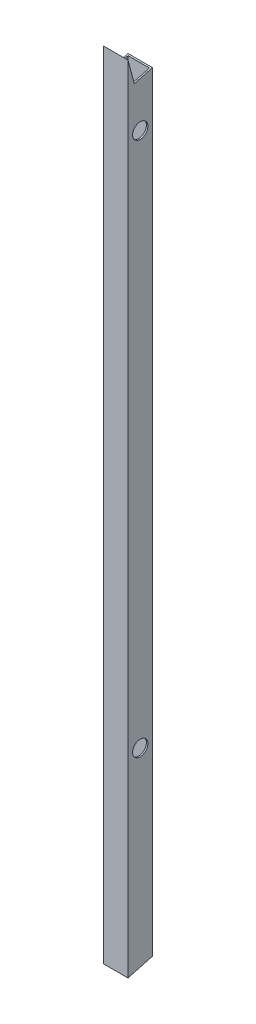
ISO-10303-21;
HEADER;
FILE_DESCRIPTION(('STEP AP214'),'2;1');
FILE_NAME('part.step','',(''),(''),'','','');
FILE_SCHEMA(('AUTOMOTIVE_DESIGN { 1 0 10303 214 1 1 1 1 }'));
ENDSEC;
DATA;
#1=APPLICATION_CONTEXT('core data for automotive mechanical design processes');
#2=APPLICATION_PROTOCOL_DEFINITION('international standard','automotive_design',2000,#1);
#3=PRODUCT_CONTEXT('',#1,'mechanical');
#4=PRODUCT('Part','Part','',(#3));
#5=PRODUCT_RELATED_PRODUCT_CATEGORY('part','',(#4));
#6=PRODUCT_DEFINITION_FORMATION('','',#4);
#7=PRODUCT_DEFINITION_CONTEXT('part definition',#1,'design');
#8=PRODUCT_DEFINITION('design','',#6,#7);
#9=PRODUCT_DEFINITION_SHAPE('','',#8);
#10=(LENGTH_UNIT() NAMED_UNIT(*) SI_UNIT(.MILLI.,.METRE.));
#11=(NAMED_UNIT(*) PLANE_ANGLE_UNIT() SI_UNIT($,.RADIAN.));
#12=(NAMED_UNIT(*) SI_UNIT($,.STERADIAN.) SOLID_ANGLE_UNIT());
#13=UNCERTAINTY_MEASURE_WITH_UNIT(LENGTH_MEASURE(1.E-05),#10,'distance_accuracy_value','');
#14=(GEOMETRIC_REPRESENTATION_CONTEXT(3) GLOBAL_UNCERTAINTY_ASSIGNED_CONTEXT((#13)) GLOBAL_UNIT_ASSIGNED_CONTEXT((#10,
#11,#12)) REPRESENTATION_CONTEXT('',''));
#15=CARTESIAN_POINT('',(0.,0.,0.));
#16=DIRECTION('',(0.,0.,1.));
#17=DIRECTION('',(1.,0.,0.));
#18=AXIS2_PLACEMENT_3D('',#15,#16,#17);
#19=CARTESIAN_POINT('',(-59.3551112863002,883.666,-50.376591230911));
#20=DIRECTION('',(1.,0.,0.));
#21=DIRECTION('',(0.,0.,-1.));
#22=AXIS2_PLACEMENT_3D('',#19,#20,#21);
#23=PLANE('',#22);
#24=CARTESIAN_POINT('',(-59.3551112863002,813.943,-37.676591230911));
#25=DIRECTION('',(1.,0.,0.));
#26=DIRECTION('',(0.,0.,-1.));
#27=AXIS2_PLACEMENT_3D('',#24,#25,#26);
#28=CIRCLE('',#27,7.93750000000006);
#29=CARTESIAN_POINT('',(-59.3551112863002,813.943,-45.6140912309111));
#30=VERTEX_POINT('',#29);
#31=EDGE_CURVE('E148',#30,#30,#28,.T.);
#32=ORIENTED_EDGE('',*,*,#31,.T.);
#33=EDGE_LOOP('',(#32));
#34=FACE_BOUND('',#33,.T.);
#35=CARTESIAN_POINT('',(-59.3551112863002,258.318,-37.676591230911));
#36=DIRECTION('',(1.,0.,0.));
#37=DIRECTION('',(0.,0.,-1.));
#38=AXIS2_PLACEMENT_3D('',#35,#36,#37);
#39=CIRCLE('',#38,7.93750000000003);
#40=CARTESIAN_POINT('',(-59.3551112863002,258.318,-45.6140912309111));
#41=VERTEX_POINT('',#40);
#42=EDGE_CURVE('E144',#41,#41,#39,.T.);
#43=ORIENTED_EDGE('',*,*,#42,.T.);
#44=EDGE_LOOP('',(#43));
#45=FACE_BOUND('',#44,.T.);
#46=DIRECTION('',(0.,-1.,0.));
#47=VECTOR('',#46,1.);
#48=CARTESIAN_POINT('',(-59.3551112863002,883.666,-50.376591230911));
#49=LINE('',#48,#47);
#50=CARTESIAN_POINT('',(-59.3551112863002,864.264645772529,-50.376591230911));
#51=VERTEX_POINT('',#50);
#52=CARTESIAN_POINT('',(-59.3551112863002,64.516,-50.376591230911));
#53=VERTEX_POINT('',#52);
#54=EDGE_CURVE('E127',#51,#53,#49,.T.);
#55=ORIENTED_EDGE('',*,*,#54,.T.);
#56=DIRECTION('',(0.,-0.260665852290765,0.965429082558387));
#57=VECTOR('',#56,1.);
#58=CARTESIAN_POINT('',(-59.3551112863002,57.658,-24.976591230911));
#59=LINE('',#58,#57);
#60=CARTESIAN_POINT('',(-59.3551112863002,57.658,-24.976591230911));
#61=VERTEX_POINT('',#60);
#62=EDGE_CURVE('E51',#53,#61,#59,.T.);
#63=ORIENTED_EDGE('',*,*,#62,.T.);
#64=DIRECTION('',(0.,-1.,0.));
#65=VECTOR('',#64,1.);
#66=CARTESIAN_POINT('',(-59.3551112863002,883.666,-24.976591230911));
#67=LINE('',#66,#65);
#68=CARTESIAN_POINT('',(-59.3551112863002,883.666,-24.976591230911));
#69=VERTEX_POINT('',#68);
#70=EDGE_CURVE('E124',#69,#61,#67,.T.);
#71=ORIENTED_EDGE('',*,*,#70,.F.);
#72=DIRECTION('',(0.,-0.965925826289067,-0.258819045102525));
#73=VECTOR('',#72,1.);
#74=CARTESIAN_POINT('',(-59.3551112863002,883.666,-24.976591230911));
#75=LINE('',#74,#73);
#76=CARTESIAN_POINT('',(-59.3551112863002,859.214290071859,-31.5284071597166));
#77=VERTEX_POINT('',#76);
#78=EDGE_CURVE('E193',#69,#77,#75,.T.);
#79=ORIENTED_EDGE('',*,*,#78,.T.);
#80=DIRECTION('',(0.,0.258819045102531,-0.965925826289066));
#81=VECTOR('',#80,1.);
#82=CARTESIAN_POINT('',(-59.3551112863002,859.214290071859,-31.5284071597166));
#83=LINE('',#82,#81);
#84=EDGE_CURVE('E196',#77,#51,#83,.T.);
#85=ORIENTED_EDGE('',*,*,#84,.T.);
#86=EDGE_LOOP('',(#55,#63,#71,#79,#85));
#87=FACE_BOUND('',#86,.T.);
#88=ADVANCED_FACE('F37',(#34,#45,#87),#23,.F.);
#89=CARTESIAN_POINT('',(-59.3551112863002,883.666,-24.976591230911));
#90=DIRECTION('',(0.,0.,-1.));
#91=DIRECTION('',(-1.,0.,0.));
#92=AXIS2_PLACEMENT_3D('',#89,#90,#91);
#93=PLANE('',#92);
#94=ORIENTED_EDGE('',*,*,#70,.T.);
#95=DIRECTION('',(1.,0.,0.));
#96=VECTOR('',#95,1.);
#97=CARTESIAN_POINT('',(-59.3551112863002,57.658,-24.976591230911));
#98=LINE('',#97,#96);
#99=CARTESIAN_POINT('',(-33.9551112863002,57.658,-24.976591230911));
#100=VERTEX_POINT('',#99);
#101=EDGE_CURVE('E110',#61,#100,#98,.T.);
#102=ORIENTED_EDGE('',*,*,#101,.T.);
#103=DIRECTION('',(0.,-1.,0.));
#104=VECTOR('',#103,1.);
#105=CARTESIAN_POINT('',(-33.9551112863002,883.666,-24.976591230911));
#106=LINE('',#105,#104);
#107=CARTESIAN_POINT('',(-33.9551112863002,883.666,-24.976591230911));
#108=VERTEX_POINT('',#107);
#109=EDGE_CURVE('E133',#108,#100,#106,.T.);
#110=ORIENTED_EDGE('',*,*,#109,.F.);
#111=DIRECTION('',(1.,0.,0.));
#112=VECTOR('',#111,1.);
#113=CARTESIAN_POINT('',(-59.3551112863002,883.666,-24.976591230911));
#114=LINE('',#113,#112);
#115=EDGE_CURVE('E131',#69,#108,#114,.T.);
#116=ORIENTED_EDGE('',*,*,#115,.F.);
#117=EDGE_LOOP('',(#94,#102,#110,#116));
#118=FACE_BOUND('',#117,.T.);
#119=ADVANCED_FACE('F130',(#118),#93,.F.);
#120=CARTESIAN_POINT('',(-33.9551112863002,883.666,-50.376591230911));
#121=DIRECTION('',(-1.,0.,0.));
#122=DIRECTION('',(0.,0.,1.));
#123=AXIS2_PLACEMENT_3D('',#120,#121,#122);
#124=PLANE('',#123);
#125=CARTESIAN_POINT('',(-33.9551112863002,813.943,-37.676591230911));
#126=DIRECTION('',(-1.,0.,0.));
#127=DIRECTION('',(0.,0.,1.));
#128=AXIS2_PLACEMENT_3D('',#125,#126,#127);
#129=CIRCLE('',#128,7.93750000000006);
#130=CARTESIAN_POINT('',(-33.9551112863002,813.943,-29.739091230911));
#131=VERTEX_POINT('',#130);
#132=EDGE_CURVE('E219',#131,#131,#129,.T.);
#133=ORIENTED_EDGE('',*,*,#132,.T.);
#134=EDGE_LOOP('',(#133));
#135=FACE_BOUND('',#134,.T.);
#136=CARTESIAN_POINT('',(-33.9551112863002,258.318,-37.676591230911));
#137=DIRECTION('',(-1.,0.,0.));
#138=DIRECTION('',(0.,0.,1.));
#139=AXIS2_PLACEMENT_3D('',#136,#137,#138);
#140=CIRCLE('',#139,7.93750000000003);
#141=CARTESIAN_POINT('',(-33.9551112863002,258.318,-29.739091230911));
#142=VERTEX_POINT('',#141);
#143=EDGE_CURVE('E226',#142,#142,#140,.T.);
#144=ORIENTED_EDGE('',*,*,#143,.T.);
#145=EDGE_LOOP('',(#144));
#146=FACE_BOUND('',#145,.T.);
#147=ORIENTED_EDGE('',*,*,#109,.T.);
#148=DIRECTION('',(0.,0.260665852290765,-0.965429082558387));
#149=VECTOR('',#148,1.);
#150=CARTESIAN_POINT('',(-33.9551112863002,120.174528287818,-256.519288593201));
#151=LINE('',#150,#149);
#152=CARTESIAN_POINT('',(-33.9551112863002,64.516,-50.376591230911));
#153=VERTEX_POINT('',#152);
#154=EDGE_CURVE('E113',#100,#153,#151,.T.);
#155=ORIENTED_EDGE('',*,*,#154,.T.);
#156=DIRECTION('',(0.,-1.,0.));
#157=VECTOR('',#156,1.);
#158=CARTESIAN_POINT('',(-33.9551112863002,883.666,-50.376591230911));
#159=LINE('',#158,#157);
#160=CARTESIAN_POINT('',(-33.9551112863002,864.264645772529,-50.376591230911));
#161=VERTEX_POINT('',#160);
#162=EDGE_CURVE('E136',#161,#153,#159,.T.);
#163=ORIENTED_EDGE('',*,*,#162,.F.);
#164=DIRECTION('',(0.,-0.258819045102531,0.965925826289066));
#165=VECTOR('',#164,1.);
#166=CARTESIAN_POINT('',(-33.9551112863002,865.564290071859,-55.226929787779));
#167=LINE('',#166,#165);
#168=CARTESIAN_POINT('',(-33.9551112863002,859.214290071859,-31.5284071597166));
#169=VERTEX_POINT('',#168);
#170=EDGE_CURVE('E170',#161,#169,#167,.T.);
#171=ORIENTED_EDGE('',*,*,#170,.T.);
#172=DIRECTION('',(0.,0.965925826289067,0.258819045102525));
#173=VECTOR('',#172,1.);
#174=CARTESIAN_POINT('',(-33.9551112863002,877.316,-26.6780686028487));
#175=LINE('',#174,#173);
#176=EDGE_CURVE('E213',#169,#108,#175,.T.);
#177=ORIENTED_EDGE('',*,*,#176,.T.);
#178=EDGE_LOOP('',(#147,#155,#163,#171,#177));
#179=FACE_BOUND('',#178,.T.);
#180=ADVANCED_FACE('F191',(#135,#146,#179),#124,.F.);
#181=CARTESIAN_POINT('',(-59.3551112863002,883.666,-50.376591230911));
#182=DIRECTION('',(0.,0.,1.));
#183=DIRECTION('',(1.,0.,0.));
#184=AXIS2_PLACEMENT_3D('',#181,#182,#183);
#185=PLANE('',#184);
#186=ORIENTED_EDGE('',*,*,#162,.T.);
#187=DIRECTION('',(1.,0.,0.));
#188=VECTOR('',#187,1.);
#189=CARTESIAN_POINT('',(-59.3551112863002,64.516,-50.376591230911));
#190=LINE('',#189,#188);
#191=EDGE_CURVE('E118',#53,#153,#190,.T.);
#192=ORIENTED_EDGE('',*,*,#191,.F.);
#193=ORIENTED_EDGE('',*,*,#54,.F.);
#194=DIRECTION('',(1.,0.,0.));
#195=VECTOR('',#194,1.);
#196=CARTESIAN_POINT('',(-59.3551112863002,864.264645772529,-50.376591230911));
#197=LINE('',#196,#195);
#198=EDGE_CURVE('E188',#51,#161,#197,.T.);
#199=ORIENTED_EDGE('',*,*,#198,.T.);
#200=EDGE_LOOP('',(#186,#192,#193,#199));
#201=FACE_BOUND('',#200,.T.);
#202=ADVANCED_FACE('F187',(#201),#185,.F.);
#203=CARTESIAN_POINT('',(-57.8311112863002,883.666,-48.852591230911));
#204=DIRECTION('',(1.,0.,0.));
#205=DIRECTION('',(0.,0.,-1.));
#206=AXIS2_PLACEMENT_3D('',#203,#204,#205);
#207=PLANE('',#206);
#208=DIRECTION('',(0.,-0.260665852290765,0.965429082558387));
#209=VECTOR('',#208,1.);
#210=CARTESIAN_POINT('',(-57.8311112863002,119.7910069904,-255.098839343504));
#211=LINE('',#210,#209);
#212=CARTESIAN_POINT('',(-57.8311112863002,64.1045200000001,-48.852591230911));
#213=VERTEX_POINT('',#212);
#214=CARTESIAN_POINT('',(-57.8311112863002,58.06948,-26.500591230911));
#215=VERTEX_POINT('',#214);
#216=EDGE_CURVE('E194',#213,#215,#211,.T.);
#217=ORIENTED_EDGE('',*,*,#216,.F.);
#218=DIRECTION('',(0.,-1.,0.));
#219=VECTOR('',#218,1.);
#220=CARTESIAN_POINT('',(-57.8311112863002,883.666,-48.852591230911));
#221=LINE('',#220,#219);
#222=CARTESIAN_POINT('',(-57.8311112863002,863.856291203264,-48.852591230911));
#223=VERTEX_POINT('',#222);
#224=EDGE_CURVE('E178',#223,#213,#221,.T.);
#225=ORIENTED_EDGE('',*,*,#224,.F.);
#226=DIRECTION('',(0.,0.258819045102531,-0.965925826289066));
#227=VECTOR('',#226,1.);
#228=CARTESIAN_POINT('',(-57.8311112863002,865.183290071859,-53.8050184300952));
#229=LINE('',#228,#227);
#230=CARTESIAN_POINT('',(-57.8311112863002,859.214290071859,-31.5284071597166));
#231=VERTEX_POINT('',#230);
#232=EDGE_CURVE('E209',#231,#223,#229,.T.);
#233=ORIENTED_EDGE('',*,*,#232,.F.);
#234=DIRECTION('',(0.,-0.965925826289067,-0.258819045102525));
#235=VECTOR('',#234,1.);
#236=CARTESIAN_POINT('',(-57.8311112863002,877.697,-26.5759799605325));
#237=LINE('',#236,#235);
#238=CARTESIAN_POINT('',(-57.8311112863002,877.978354569265,-26.500591230911));
#239=VERTEX_POINT('',#238);
#240=EDGE_CURVE('E169',#239,#231,#237,.T.);
#241=ORIENTED_EDGE('',*,*,#240,.F.);
#242=DIRECTION('',(0.,-1.,0.));
#243=VECTOR('',#242,1.);
#244=CARTESIAN_POINT('',(-57.8311112863002,883.666,-26.500591230911));
#245=LINE('',#244,#243);
#246=EDGE_CURVE('E168',#239,#215,#245,.T.);
#247=ORIENTED_EDGE('',*,*,#246,.T.);
#248=EDGE_LOOP('',(#217,#225,#233,#241,#247));
#249=FACE_BOUND('',#248,.T.);
#250=CARTESIAN_POINT('',(-57.8311112863002,813.943,-37.676591230911));
#251=DIRECTION('',(1.,0.,0.));
#252=DIRECTION('',(0.,0.,-1.));
#253=AXIS2_PLACEMENT_3D('',#250,#251,#252);
#254=CIRCLE('',#253,7.93750000000006);
#255=CARTESIAN_POINT('',(-57.8311112863002,813.943,-45.6140912309111));
#256=VERTEX_POINT('',#255);
#257=EDGE_CURVE('E147',#256,#256,#254,.T.);
#258=ORIENTED_EDGE('',*,*,#257,.F.);
#259=EDGE_LOOP('',(#258));
#260=FACE_BOUND('',#259,.T.);
#261=CARTESIAN_POINT('',(-57.8311112863002,258.318,-37.676591230911));
#262=DIRECTION('',(1.,0.,0.));
#263=DIRECTION('',(0.,0.,-1.));
#264=AXIS2_PLACEMENT_3D('',#261,#262,#263);
#265=CIRCLE('',#264,7.93750000000003);
#266=CARTESIAN_POINT('',(-57.8311112863002,258.318,-45.6140912309111));
#267=VERTEX_POINT('',#266);
#268=EDGE_CURVE('E143',#267,#267,#265,.T.);
#269=ORIENTED_EDGE('',*,*,#268,.F.);
#270=EDGE_LOOP('',(#269));
#271=FACE_BOUND('',#270,.T.);
#272=ADVANCED_FACE('F237',(#249,#260,#271),#207,.T.);
#273=CARTESIAN_POINT('',(-57.8311112863002,883.666,-26.500591230911));
#274=DIRECTION('',(0.,0.,-1.));
#275=DIRECTION('',(-1.,0.,0.));
#276=AXIS2_PLACEMENT_3D('',#273,#274,#275);
#277=PLANE('',#276);
#278=DIRECTION('',(1.,0.,0.));
#279=VECTOR('',#278,1.);
#280=CARTESIAN_POINT('',(-57.8311112863002,58.06948,-26.500591230911));
#281=LINE('',#280,#279);
#282=CARTESIAN_POINT('',(-35.4791112863002,58.06948,-26.500591230911));
#283=VERTEX_POINT('',#282);
#284=EDGE_CURVE('E198',#215,#283,#281,.T.);
#285=ORIENTED_EDGE('',*,*,#284,.F.);
#286=ORIENTED_EDGE('',*,*,#246,.F.);
#287=DIRECTION('',(-1.,0.,0.));
#288=VECTOR('',#287,1.);
#289=CARTESIAN_POINT('',(-57.8311112863002,877.978354569265,-26.500591230911));
#290=LINE('',#289,#288);
#291=CARTESIAN_POINT('',(-35.4791112863002,877.978354569265,-26.500591230911));
#292=VERTEX_POINT('',#291);
#293=EDGE_CURVE('E154',#292,#239,#290,.T.);
#294=ORIENTED_EDGE('',*,*,#293,.F.);
#295=DIRECTION('',(0.,-1.,0.));
#296=VECTOR('',#295,1.);
#297=CARTESIAN_POINT('',(-35.4791112863002,883.666,-26.500591230911));
#298=LINE('',#297,#296);
#299=EDGE_CURVE('E166',#292,#283,#298,.T.);
#300=ORIENTED_EDGE('',*,*,#299,.T.);
#301=EDGE_LOOP('',(#285,#286,#294,#300));
#302=FACE_BOUND('',#301,.T.);
#303=ADVANCED_FACE('F165',(#302),#277,.T.);
#304=CARTESIAN_POINT('',(-35.4791112863002,883.666,-48.852591230911));
#305=DIRECTION('',(-1.,0.,0.));
#306=DIRECTION('',(0.,0.,1.));
#307=AXIS2_PLACEMENT_3D('',#304,#305,#306);
#308=PLANE('',#307);
#309=DIRECTION('',(0.,0.260665852290765,-0.965429082558387));
#310=VECTOR('',#309,1.);
#311=CARTESIAN_POINT('',(-35.4791112863002,119.7910069904,-255.098839343504));
#312=LINE('',#311,#310);
#313=CARTESIAN_POINT('',(-35.4791112863002,64.1045200000001,-48.852591230911));
#314=VERTEX_POINT('',#313);
#315=EDGE_CURVE('E58',#283,#314,#312,.T.);
#316=ORIENTED_EDGE('',*,*,#315,.F.);
#317=ORIENTED_EDGE('',*,*,#299,.F.);
#318=DIRECTION('',(0.,0.965925826289067,0.258819045102525));
#319=VECTOR('',#318,1.);
#320=CARTESIAN_POINT('',(-35.4791112863002,877.697,-26.5759799605325));
#321=LINE('',#320,#319);
#322=CARTESIAN_POINT('',(-35.4791112863002,859.214290071859,-31.5284071597166));
#323=VERTEX_POINT('',#322);
#324=EDGE_CURVE('E44',#323,#292,#321,.T.);
#325=ORIENTED_EDGE('',*,*,#324,.F.);
#326=DIRECTION('',(0.,-0.258819045102531,0.965925826289066));
#327=VECTOR('',#326,1.);
#328=CARTESIAN_POINT('',(-35.4791112863002,865.183290071859,-53.8050184300952));
#329=LINE('',#328,#327);
#330=CARTESIAN_POINT('',(-35.4791112863002,863.856291203264,-48.852591230911));
#331=VERTEX_POINT('',#330);
#332=EDGE_CURVE('E204',#331,#323,#329,.T.);
#333=ORIENTED_EDGE('',*,*,#332,.F.);
#334=DIRECTION('',(0.,-1.,0.));
#335=VECTOR('',#334,1.);
#336=CARTESIAN_POINT('',(-35.4791112863002,883.666,-48.852591230911));
#337=LINE('',#336,#335);
#338=EDGE_CURVE('E175',#331,#314,#337,.T.);
#339=ORIENTED_EDGE('',*,*,#338,.T.);
#340=EDGE_LOOP('',(#316,#317,#325,#333,#339));
#341=FACE_BOUND('',#340,.T.);
#342=CARTESIAN_POINT('',(-35.4791112863002,813.943,-37.676591230911));
#343=DIRECTION('',(-1.,0.,0.));
#344=DIRECTION('',(0.,0.,1.));
#345=AXIS2_PLACEMENT_3D('',#342,#343,#344);
#346=CIRCLE('',#345,7.93750000000006);
#347=CARTESIAN_POINT('',(-35.4791112863002,813.943,-29.739091230911));
#348=VERTEX_POINT('',#347);
#349=EDGE_CURVE('E145',#348,#348,#346,.T.);
#350=ORIENTED_EDGE('',*,*,#349,.F.);
#351=EDGE_LOOP('',(#350));
#352=FACE_BOUND('',#351,.T.);
#353=CARTESIAN_POINT('',(-35.4791112863002,258.318,-37.676591230911));
#354=DIRECTION('',(-1.,0.,0.));
#355=DIRECTION('',(0.,0.,1.));
#356=AXIS2_PLACEMENT_3D('',#353,#354,#355);
#357=CIRCLE('',#356,7.93750000000003);
#358=CARTESIAN_POINT('',(-35.4791112863002,258.318,-29.739091230911));
#359=VERTEX_POINT('',#358);
#360=EDGE_CURVE('E140',#359,#359,#357,.T.);
#361=ORIENTED_EDGE('',*,*,#360,.F.);
#362=EDGE_LOOP('',(#361));
#363=FACE_BOUND('',#362,.T.);
#364=ADVANCED_FACE('F172',(#341,#352,#363),#308,.T.);
#365=CARTESIAN_POINT('',(-57.8311112863002,883.666,-48.852591230911));
#366=DIRECTION('',(0.,0.,1.));
#367=DIRECTION('',(1.,0.,0.));
#368=AXIS2_PLACEMENT_3D('',#365,#366,#367);
#369=PLANE('',#368);
#370=DIRECTION('',(-1.,0.,0.));
#371=VECTOR('',#370,1.);
#372=CARTESIAN_POINT('',(-57.8311112863002,64.1045200000001,-48.852591230911));
#373=LINE('',#372,#371);
#374=EDGE_CURVE('E11',#314,#213,#373,.T.);
#375=ORIENTED_EDGE('',*,*,#374,.F.);
#376=ORIENTED_EDGE('',*,*,#338,.F.);
#377=DIRECTION('',(1.,0.,0.));
#378=VECTOR('',#377,1.);
#379=CARTESIAN_POINT('',(-57.8311112863002,863.856291203264,-48.852591230911));
#380=LINE('',#379,#378);
#381=EDGE_CURVE('E132',#223,#331,#380,.T.);
#382=ORIENTED_EDGE('',*,*,#381,.F.);
#383=ORIENTED_EDGE('',*,*,#224,.T.);
#384=EDGE_LOOP('',(#375,#376,#382,#383));
#385=FACE_BOUND('',#384,.T.);
#386=ADVANCED_FACE('F232',(#385),#369,.T.);
#387=CARTESIAN_POINT('',(-59.3551112863002,258.318,-37.676591230911));
#388=DIRECTION('',(1.,0.,0.));
#389=DIRECTION('',(0.,0.,-1.));
#390=AXIS2_PLACEMENT_3D('',#387,#388,#389);
#391=CYLINDRICAL_SURFACE('',#390,7.93750000000003);
#392=ORIENTED_EDGE('',*,*,#360,.T.);
#393=EDGE_LOOP('',(#392));
#394=FACE_BOUND('',#393,.T.);
#395=ORIENTED_EDGE('',*,*,#143,.F.);
#396=EDGE_LOOP('',(#395));
#397=FACE_BOUND('',#396,.T.);
#398=ADVANCED_FACE('F261',(#394,#397),#391,.F.);
#399=ORIENTED_EDGE('',*,*,#268,.T.);
#400=EDGE_LOOP('',(#399));
#401=FACE_BOUND('',#400,.T.);
#402=ORIENTED_EDGE('',*,*,#42,.F.);
#403=EDGE_LOOP('',(#402));
#404=FACE_BOUND('',#403,.T.);
#405=ADVANCED_FACE('F258',(#401,#404),#391,.F.);
#406=CARTESIAN_POINT('',(-59.3551112863002,813.943,-37.676591230911));
#407=DIRECTION('',(1.,0.,0.));
#408=DIRECTION('',(0.,0.,-1.));
#409=AXIS2_PLACEMENT_3D('',#406,#407,#408);
#410=CYLINDRICAL_SURFACE('',#409,7.93750000000006);
#411=ORIENTED_EDGE('',*,*,#349,.T.);
#412=EDGE_LOOP('',(#411));
#413=FACE_BOUND('',#412,.T.);
#414=ORIENTED_EDGE('',*,*,#132,.F.);
#415=EDGE_LOOP('',(#414));
#416=FACE_BOUND('',#415,.T.);
#417=ADVANCED_FACE('F260',(#413,#416),#410,.F.);
#418=ORIENTED_EDGE('',*,*,#257,.T.);
#419=EDGE_LOOP('',(#418));
#420=FACE_BOUND('',#419,.T.);
#421=ORIENTED_EDGE('',*,*,#31,.F.);
#422=EDGE_LOOP('',(#421));
#423=FACE_BOUND('',#422,.T.);
#424=ADVANCED_FACE('F268',(#420,#423),#410,.F.);
#425=CARTESIAN_POINT('',(-59.3551112863002,883.666,-24.976591230911));
#426=DIRECTION('',(0.,-0.258819045102525,0.965925826289067));
#427=DIRECTION('',(0.,-0.965925826289067,-0.258819045102525));
#428=AXIS2_PLACEMENT_3D('',#425,#426,#427);
#429=PLANE('',#428);
#430=DIRECTION('',(1.,0.,0.));
#431=VECTOR('',#430,1.);
#432=CARTESIAN_POINT('',(-59.3551112863002,859.214290071859,-31.5284071597166));
#433=LINE('',#432,#431);
#434=EDGE_CURVE('E157',#323,#169,#433,.T.);
#435=ORIENTED_EDGE('',*,*,#434,.F.);
#436=ORIENTED_EDGE('',*,*,#324,.T.);
#437=ORIENTED_EDGE('',*,*,#293,.T.);
#438=ORIENTED_EDGE('',*,*,#240,.T.);
#439=EDGE_CURVE('E205',#77,#231,#433,.T.);
#440=ORIENTED_EDGE('',*,*,#439,.F.);
#441=ORIENTED_EDGE('',*,*,#78,.F.);
#442=ORIENTED_EDGE('',*,*,#115,.T.);
#443=ORIENTED_EDGE('',*,*,#176,.F.);
#444=EDGE_LOOP('',(#435,#436,#437,#438,#440,#441,#442,#443));
#445=FACE_BOUND('',#444,.T.);
#446=ADVANCED_FACE('F153',(#445),#429,.F.);
#447=CARTESIAN_POINT('',(-59.3551112863002,859.214290071859,-31.5284071597166));
#448=DIRECTION('',(0.,-0.965925826289066,-0.258819045102531));
#449=DIRECTION('',(0.,0.258819045102531,-0.965925826289066));
#450=AXIS2_PLACEMENT_3D('',#447,#448,#449);
#451=PLANE('',#450);
#452=ORIENTED_EDGE('',*,*,#198,.F.);
#453=ORIENTED_EDGE('',*,*,#84,.F.);
#454=ORIENTED_EDGE('',*,*,#439,.T.);
#455=ORIENTED_EDGE('',*,*,#232,.T.);
#456=ORIENTED_EDGE('',*,*,#381,.T.);
#457=ORIENTED_EDGE('',*,*,#332,.T.);
#458=ORIENTED_EDGE('',*,*,#434,.T.);
#459=ORIENTED_EDGE('',*,*,#170,.F.);
#460=EDGE_LOOP('',(#452,#453,#454,#455,#456,#457,#458,#459));
#461=FACE_BOUND('',#460,.T.);
#462=ADVANCED_FACE('F242',(#461),#451,.F.);
#463=CARTESIAN_POINT('',(-59.3551112863002,57.658,-24.976591230911));
#464=DIRECTION('',(0.,0.965429082558387,0.260665852290765));
#465=DIRECTION('',(0.,-0.260665852290765,0.965429082558387));
#466=AXIS2_PLACEMENT_3D('',#463,#464,#465);
#467=PLANE('',#466);
#468=ORIENTED_EDGE('',*,*,#216,.T.);
#469=ORIENTED_EDGE('',*,*,#284,.T.);
#470=ORIENTED_EDGE('',*,*,#315,.T.);
#471=ORIENTED_EDGE('',*,*,#374,.T.);
#472=EDGE_LOOP('',(#468,#469,#470,#471));
#473=FACE_BOUND('',#472,.T.);
#474=ORIENTED_EDGE('',*,*,#101,.F.);
#475=ORIENTED_EDGE('',*,*,#62,.F.);
#476=ORIENTED_EDGE('',*,*,#191,.T.);
#477=ORIENTED_EDGE('',*,*,#154,.F.);
#478=EDGE_LOOP('',(#474,#475,#476,#477));
#479=FACE_BOUND('',#478,.T.);
#480=ADVANCED_FACE('F111',(#473,#479),#467,.F.);
#481=CLOSED_SHELL('',(#88,#119,#180,#202,#272,#303,#364,#386,#398,#405,#417,#424,#446,#462,#480));
#482=MANIFOLD_SOLID_BREP('B2',#481);
#483=ADVANCED_BREP_SHAPE_REPRESENTATION('',(#18,#482),#14);
#484=SHAPE_DEFINITION_REPRESENTATION(#9,#483);
ENDSEC;
END-ISO-10303-21;
